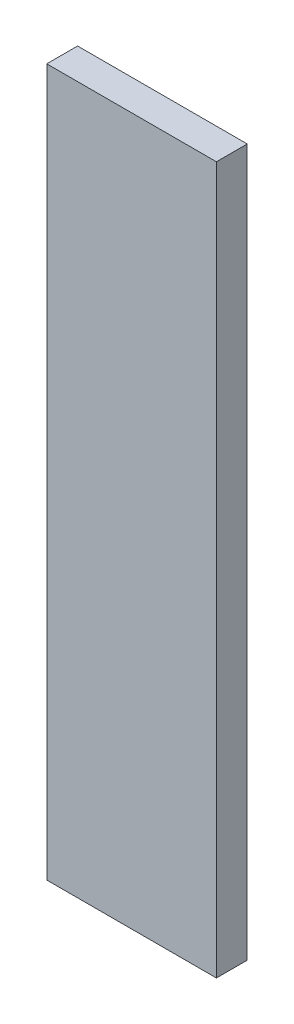
ISO-10303-21;
HEADER;
FILE_DESCRIPTION(('STEP AP214'),'2;1');
FILE_NAME('part.step','',(''),(''),'','','');
FILE_SCHEMA(('AUTOMOTIVE_DESIGN { 1 0 10303 214 1 1 1 1 }'));
ENDSEC;
DATA;
#1=APPLICATION_CONTEXT('core data for automotive mechanical design processes');
#2=APPLICATION_PROTOCOL_DEFINITION('international standard','automotive_design',2000,#1);
#3=PRODUCT_CONTEXT('',#1,'mechanical');
#4=PRODUCT('Part','Part','',(#3));
#5=PRODUCT_RELATED_PRODUCT_CATEGORY('part','',(#4));
#6=PRODUCT_DEFINITION_FORMATION('','',#4);
#7=PRODUCT_DEFINITION_CONTEXT('part definition',#1,'design');
#8=PRODUCT_DEFINITION('design','',#6,#7);
#9=PRODUCT_DEFINITION_SHAPE('','',#8);
#10=(LENGTH_UNIT() NAMED_UNIT(*) SI_UNIT(.MILLI.,.METRE.));
#11=(NAMED_UNIT(*) PLANE_ANGLE_UNIT() SI_UNIT($,.RADIAN.));
#12=(NAMED_UNIT(*) SI_UNIT($,.STERADIAN.) SOLID_ANGLE_UNIT());
#13=UNCERTAINTY_MEASURE_WITH_UNIT(LENGTH_MEASURE(1.E-05),#10,'distance_accuracy_value','');
#14=(GEOMETRIC_REPRESENTATION_CONTEXT(3) GLOBAL_UNCERTAINTY_ASSIGNED_CONTEXT((#13)) GLOBAL_UNIT_ASSIGNED_CONTEXT((#10,
#11,#12)) REPRESENTATION_CONTEXT('',''));
#15=CARTESIAN_POINT('',(0.,0.,0.));
#16=DIRECTION('',(0.,0.,1.));
#17=DIRECTION('',(1.,0.,0.));
#18=AXIS2_PLACEMENT_3D('',#15,#16,#17);
#19=CARTESIAN_POINT('',(0.,255.,-6.));
#20=DIRECTION('',(0.,1.,0.));
#21=DIRECTION('',(0.,0.,1.));
#22=AXIS2_PLACEMENT_3D('',#19,#20,#21);
#23=PLANE('',#22);
#24=DIRECTION('',(-1.,0.,0.));
#25=VECTOR('',#24,1.);
#26=CARTESIAN_POINT('',(0.,255.,-6.));
#27=LINE('',#26,#25);
#28=CARTESIAN_POINT('',(13.,255.,-6.));
#29=VERTEX_POINT('',#28);
#30=CARTESIAN_POINT('',(-23.0000000000001,255.,-6.));
#31=VERTEX_POINT('',#30);
#32=EDGE_CURVE('E61',#29,#31,#27,.T.);
#33=ORIENTED_EDGE('',*,*,#32,.F.);
#34=DIRECTION('',(0.,0.,-1.));
#35=VECTOR('',#34,1.);
#36=CARTESIAN_POINT('',(13.,255.,28.2842712474619));
#37=LINE('',#36,#35);
#38=CARTESIAN_POINT('',(13.,255.,0.));
#39=VERTEX_POINT('',#38);
#40=EDGE_CURVE('E53',#29,#39,#37,.F.);
#41=ORIENTED_EDGE('',*,*,#40,.T.);
#42=DIRECTION('',(-1.,0.,0.));
#43=VECTOR('',#42,1.);
#44=CARTESIAN_POINT('',(0.,255.,0.));
#45=LINE('',#44,#43);
#46=CARTESIAN_POINT('',(-23.0000000000001,255.,0.));
#47=VERTEX_POINT('',#46);
#48=EDGE_CURVE('E73',#39,#47,#45,.T.);
#49=ORIENTED_EDGE('',*,*,#48,.T.);
#50=DIRECTION('',(0.,0.,1.));
#51=VECTOR('',#50,1.);
#52=CARTESIAN_POINT('',(-23.0000000000001,255.,-6.));
#53=LINE('',#52,#51);
#54=EDGE_CURVE('E12',#31,#47,#53,.T.);
#55=ORIENTED_EDGE('',*,*,#54,.F.);
#56=EDGE_LOOP('',(#33,#41,#49,#55));
#57=FACE_BOUND('',#56,.T.);
#58=ADVANCED_FACE('F37',(#57),#23,.F.);
#59=CARTESIAN_POINT('',(-23.0000000000001,0.,-6.));
#60=DIRECTION('',(1.,0.,0.));
#61=DIRECTION('',(0.,0.,-1.));
#62=AXIS2_PLACEMENT_3D('',#59,#60,#61);
#63=PLANE('',#62);
#64=ORIENTED_EDGE('',*,*,#54,.T.);
#65=DIRECTION('',(0.,-1.,0.));
#66=VECTOR('',#65,1.);
#67=CARTESIAN_POINT('',(-23.0000000000001,275.,0.));
#68=LINE('',#67,#66);
#69=CARTESIAN_POINT('',(-23.0000000000001,-6.71301902954724E-12,0.));
#70=VERTEX_POINT('',#69);
#71=EDGE_CURVE('E161',#47,#70,#68,.T.);
#72=ORIENTED_EDGE('',*,*,#71,.T.);
#73=DIRECTION('',(0.,0.,-1.));
#74=VECTOR('',#73,1.);
#75=CARTESIAN_POINT('',(-23.0000000000001,-6.71301902954724E-12,6.));
#76=LINE('',#75,#74);
#77=CARTESIAN_POINT('',(-23.0000000000001,-6.71301902954724E-12,6.));
#78=VERTEX_POINT('',#77);
#79=EDGE_CURVE('E160',#78,#70,#76,.T.);
#80=ORIENTED_EDGE('',*,*,#79,.F.);
#81=DIRECTION('',(0.,-1.,0.));
#82=VECTOR('',#81,1.);
#83=CARTESIAN_POINT('',(-23.0000000000001,275.,6.));
#84=LINE('',#83,#82);
#85=CARTESIAN_POINT('',(-23.0000000000001,275.,6.));
#86=VERTEX_POINT('',#85);
#87=EDGE_CURVE('E151',#86,#78,#84,.T.);
#88=ORIENTED_EDGE('',*,*,#87,.F.);
#89=DIRECTION('',(0.,0.,1.));
#90=VECTOR('',#89,1.);
#91=CARTESIAN_POINT('',(-23.0000000000001,275.,-6.));
#92=LINE('',#91,#90);
#93=CARTESIAN_POINT('',(-23.0000000000001,275.,-6.));
#94=VERTEX_POINT('',#93);
#95=EDGE_CURVE('E45',#94,#86,#92,.T.);
#96=ORIENTED_EDGE('',*,*,#95,.F.);
#97=DIRECTION('',(0.,1.,0.));
#98=VECTOR('',#97,1.);
#99=CARTESIAN_POINT('',(-23.0000000000001,0.,-6.));
#100=LINE('',#99,#98);
#101=EDGE_CURVE('E104',#31,#94,#100,.T.);
#102=ORIENTED_EDGE('',*,*,#101,.F.);
#103=EDGE_LOOP('',(#64,#72,#80,#88,#96,#102));
#104=FACE_BOUND('',#103,.T.);
#105=ADVANCED_FACE('F206',(#104),#63,.F.);
#106=CARTESIAN_POINT('',(0.,275.,-6.));
#107=DIRECTION('',(0.,-1.,0.));
#108=DIRECTION('',(0.,0.,-1.));
#109=AXIS2_PLACEMENT_3D('',#106,#107,#108);
#110=PLANE('',#109);
#111=ORIENTED_EDGE('',*,*,#95,.T.);
#112=DIRECTION('',(-1.,0.,0.));
#113=VECTOR('',#112,1.);
#114=CARTESIAN_POINT('',(43.,275.,6.));
#115=LINE('',#114,#113);
#116=CARTESIAN_POINT('',(43.,275.,6.));
#117=VERTEX_POINT('',#116);
#118=EDGE_CURVE('E116',#117,#86,#115,.T.);
#119=ORIENTED_EDGE('',*,*,#118,.F.);
#120=DIRECTION('',(0.,0.,1.));
#121=VECTOR('',#120,1.);
#122=CARTESIAN_POINT('',(43.,275.,-5.99999999999994));
#123=LINE('',#122,#121);
#124=CARTESIAN_POINT('',(43.,275.,-5.99999999999994));
#125=VERTEX_POINT('',#124);
#126=EDGE_CURVE('E112',#125,#117,#123,.T.);
#127=ORIENTED_EDGE('',*,*,#126,.F.);
#128=DIRECTION('',(1.,0.,0.));
#129=VECTOR('',#128,1.);
#130=CARTESIAN_POINT('',(0.,275.,-6.));
#131=LINE('',#130,#129);
#132=EDGE_CURVE('E96',#94,#125,#131,.T.);
#133=ORIENTED_EDGE('',*,*,#132,.F.);
#134=EDGE_LOOP('',(#111,#119,#127,#133));
#135=FACE_BOUND('',#134,.T.);
#136=ADVANCED_FACE('F113',(#135),#110,.F.);
#137=CARTESIAN_POINT('',(43.,0.,-5.99999999999994));
#138=DIRECTION('',(1.,0.,0.));
#139=DIRECTION('',(0.,0.,-1.));
#140=AXIS2_PLACEMENT_3D('',#137,#138,#139);
#141=PLANE('',#140);
#142=ORIENTED_EDGE('',*,*,#126,.T.);
#143=DIRECTION('',(0.,1.,0.));
#144=VECTOR('',#143,1.);
#145=CARTESIAN_POINT('',(43.,275.,6.));
#146=LINE('',#145,#144);
#147=CARTESIAN_POINT('',(43.,-6.71301902954724E-12,6.));
#148=VERTEX_POINT('',#147);
#149=EDGE_CURVE('E142',#148,#117,#146,.T.);
#150=ORIENTED_EDGE('',*,*,#149,.F.);
#151=DIRECTION('',(0.,0.,1.));
#152=VECTOR('',#151,1.);
#153=CARTESIAN_POINT('',(43.,0.,-5.99999999999994));
#154=LINE('',#153,#152);
#155=CARTESIAN_POINT('',(43.,0.,-5.99999999999994));
#156=VERTEX_POINT('',#155);
#157=EDGE_CURVE('E120',#156,#148,#154,.T.);
#158=ORIENTED_EDGE('',*,*,#157,.F.);
#159=DIRECTION('',(0.,1.,0.));
#160=VECTOR('',#159,1.);
#161=CARTESIAN_POINT('',(43.,0.,-5.99999999999994));
#162=LINE('',#161,#160);
#163=EDGE_CURVE('E102',#156,#125,#162,.T.);
#164=ORIENTED_EDGE('',*,*,#163,.T.);
#165=EDGE_LOOP('',(#142,#150,#158,#164));
#166=FACE_BOUND('',#165,.T.);
#167=ADVANCED_FACE('F122',(#166),#141,.T.);
#168=CARTESIAN_POINT('',(0.,0.,-6.));
#169=DIRECTION('',(0.,-1.,0.));
#170=DIRECTION('',(1.,0.,0.));
#171=AXIS2_PLACEMENT_3D('',#168,#169,#170);
#172=PLANE('',#171);
#173=ORIENTED_EDGE('',*,*,#157,.T.);
#174=DIRECTION('',(1.,0.,0.));
#175=VECTOR('',#174,1.);
#176=CARTESIAN_POINT('',(43.,-6.71301902954724E-12,6.));
#177=LINE('',#176,#175);
#178=EDGE_CURVE('E155',#78,#148,#177,.T.);
#179=ORIENTED_EDGE('',*,*,#178,.F.);
#180=ORIENTED_EDGE('',*,*,#79,.T.);
#181=DIRECTION('',(1.,0.,0.));
#182=VECTOR('',#181,1.);
#183=CARTESIAN_POINT('',(43.,-6.71301902954724E-12,0.));
#184=LINE('',#183,#182);
#185=CARTESIAN_POINT('',(23.,-6.71301902954724E-12,0.));
#186=VERTEX_POINT('',#185);
#187=EDGE_CURVE('E146',#70,#186,#184,.T.);
#188=ORIENTED_EDGE('',*,*,#187,.T.);
#189=DIRECTION('',(0.,0.,1.));
#190=VECTOR('',#189,1.);
#191=CARTESIAN_POINT('',(23.,0.,-5.99999999999994));
#192=LINE('',#191,#190);
#193=CARTESIAN_POINT('',(23.,0.,-5.99999999999994));
#194=VERTEX_POINT('',#193);
#195=EDGE_CURVE('E40',#194,#186,#192,.T.);
#196=ORIENTED_EDGE('',*,*,#195,.F.);
#197=DIRECTION('',(1.,0.,0.));
#198=VECTOR('',#197,1.);
#199=CARTESIAN_POINT('',(0.,0.,-6.));
#200=LINE('',#199,#198);
#201=EDGE_CURVE('E124',#194,#156,#200,.T.);
#202=ORIENTED_EDGE('',*,*,#201,.T.);
#203=EDGE_LOOP('',(#173,#179,#180,#188,#196,#202));
#204=FACE_BOUND('',#203,.T.);
#205=ADVANCED_FACE('F187',(#204),#172,.T.);
#206=CARTESIAN_POINT('',(23.,0.,-5.99999999999994));
#207=DIRECTION('',(-1.,0.,0.));
#208=DIRECTION('',(0.,0.,1.));
#209=AXIS2_PLACEMENT_3D('',#206,#207,#208);
#210=PLANE('',#209);
#211=DIRECTION('',(0.,0.,-1.));
#212=VECTOR('',#211,1.);
#213=CARTESIAN_POINT('',(23.,245.,28.2842712474619));
#214=LINE('',#213,#212);
#215=CARTESIAN_POINT('',(23.,245.,-6.));
#216=VERTEX_POINT('',#215);
#217=CARTESIAN_POINT('',(23.,245.,0.));
#218=VERTEX_POINT('',#217);
#219=EDGE_CURVE('E301',#216,#218,#214,.F.);
#220=ORIENTED_EDGE('',*,*,#219,.F.);
#221=DIRECTION('',(0.,-1.,0.));
#222=VECTOR('',#221,1.);
#223=CARTESIAN_POINT('',(23.,0.,-5.99999999999994));
#224=LINE('',#223,#222);
#225=EDGE_CURVE('E127',#216,#194,#224,.T.);
#226=ORIENTED_EDGE('',*,*,#225,.T.);
#227=ORIENTED_EDGE('',*,*,#195,.T.);
#228=DIRECTION('',(0.,-1.,0.));
#229=VECTOR('',#228,1.);
#230=CARTESIAN_POINT('',(23.,0.,0.));
#231=LINE('',#230,#229);
#232=EDGE_CURVE('E84',#218,#186,#231,.T.);
#233=ORIENTED_EDGE('',*,*,#232,.F.);
#234=EDGE_LOOP('',(#220,#226,#227,#233));
#235=FACE_BOUND('',#234,.T.);
#236=ADVANCED_FACE('F185',(#235),#210,.T.);
#237=CARTESIAN_POINT('',(0.,0.,-6.));
#238=DIRECTION('',(0.,0.,1.));
#239=DIRECTION('',(1.,0.,0.));
#240=AXIS2_PLACEMENT_3D('',#237,#238,#239);
#241=PLANE('',#240);
#242=ORIENTED_EDGE('',*,*,#225,.F.);
#243=CARTESIAN_POINT('',(23.,255.,-6.));
#244=DIRECTION('',(0.,0.,-1.));
#245=DIRECTION('',(-1.,0.,0.));
#246=AXIS2_PLACEMENT_3D('',#243,#244,#245);
#247=CIRCLE('',#246,10.);
#248=EDGE_CURVE('E197',#29,#216,#247,.T.);
#249=ORIENTED_EDGE('',*,*,#248,.F.);
#250=ORIENTED_EDGE('',*,*,#32,.T.);
#251=ORIENTED_EDGE('',*,*,#101,.T.);
#252=ORIENTED_EDGE('',*,*,#132,.T.);
#253=ORIENTED_EDGE('',*,*,#163,.F.);
#254=ORIENTED_EDGE('',*,*,#201,.F.);
#255=EDGE_LOOP('',(#242,#249,#250,#251,#252,#253,#254));
#256=FACE_BOUND('',#255,.T.);
#257=ADVANCED_FACE('F99',(#256),#241,.F.);
#258=CARTESIAN_POINT('',(0.,0.,0.));
#259=DIRECTION('',(0.,0.,-1.));
#260=DIRECTION('',(-1.,0.,0.));
#261=AXIS2_PLACEMENT_3D('',#258,#259,#260);
#262=PLANE('',#261);
#263=ORIENTED_EDGE('',*,*,#48,.F.);
#264=CARTESIAN_POINT('',(23.,255.,0.));
#265=DIRECTION('',(0.,0.,-1.));
#266=DIRECTION('',(-1.,0.,0.));
#267=AXIS2_PLACEMENT_3D('',#264,#265,#266);
#268=CIRCLE('',#267,10.);
#269=EDGE_CURVE('E302',#218,#39,#268,.F.);
#270=ORIENTED_EDGE('',*,*,#269,.F.);
#271=ORIENTED_EDGE('',*,*,#232,.T.);
#272=ORIENTED_EDGE('',*,*,#187,.F.);
#273=ORIENTED_EDGE('',*,*,#71,.F.);
#274=EDGE_LOOP('',(#263,#270,#271,#272,#273));
#275=FACE_BOUND('',#274,.T.);
#276=ADVANCED_FACE('F190',(#275),#262,.T.);
#277=CARTESIAN_POINT('',(0.,0.,6.));
#278=DIRECTION('',(0.,0.,-1.));
#279=DIRECTION('',(-1.,0.,0.));
#280=AXIS2_PLACEMENT_3D('',#277,#278,#279);
#281=PLANE('',#280);
#282=ORIENTED_EDGE('',*,*,#149,.T.);
#283=ORIENTED_EDGE('',*,*,#118,.T.);
#284=ORIENTED_EDGE('',*,*,#87,.T.);
#285=ORIENTED_EDGE('',*,*,#178,.T.);
#286=EDGE_LOOP('',(#282,#283,#284,#285));
#287=FACE_BOUND('',#286,.T.);
#288=ADVANCED_FACE('F205',(#287),#281,.F.);
#289=CARTESIAN_POINT('',(23.,255.,28.2842712474619));
#290=DIRECTION('',(0.,0.,-1.));
#291=DIRECTION('',(-1.,0.,0.));
#292=AXIS2_PLACEMENT_3D('',#289,#290,#291);
#293=CYLINDRICAL_SURFACE('',#292,10.);
#294=ORIENTED_EDGE('',*,*,#248,.T.);
#295=ORIENTED_EDGE('',*,*,#219,.T.);
#296=ORIENTED_EDGE('',*,*,#269,.T.);
#297=ORIENTED_EDGE('',*,*,#40,.F.);
#298=EDGE_LOOP('',(#294,#295,#296,#297));
#299=FACE_BOUND('',#298,.T.);
#300=ADVANCED_FACE('F230',(#299),#293,.F.);
#301=CLOSED_SHELL('',(#58,#105,#136,#167,#205,#236,#257,#276,#288,#300));
#302=MANIFOLD_SOLID_BREP('B2',#301);
#303=ADVANCED_BREP_SHAPE_REPRESENTATION('',(#18,#302),#14);
#304=SHAPE_DEFINITION_REPRESENTATION(#9,#303);
ENDSEC;
END-ISO-10303-21;
